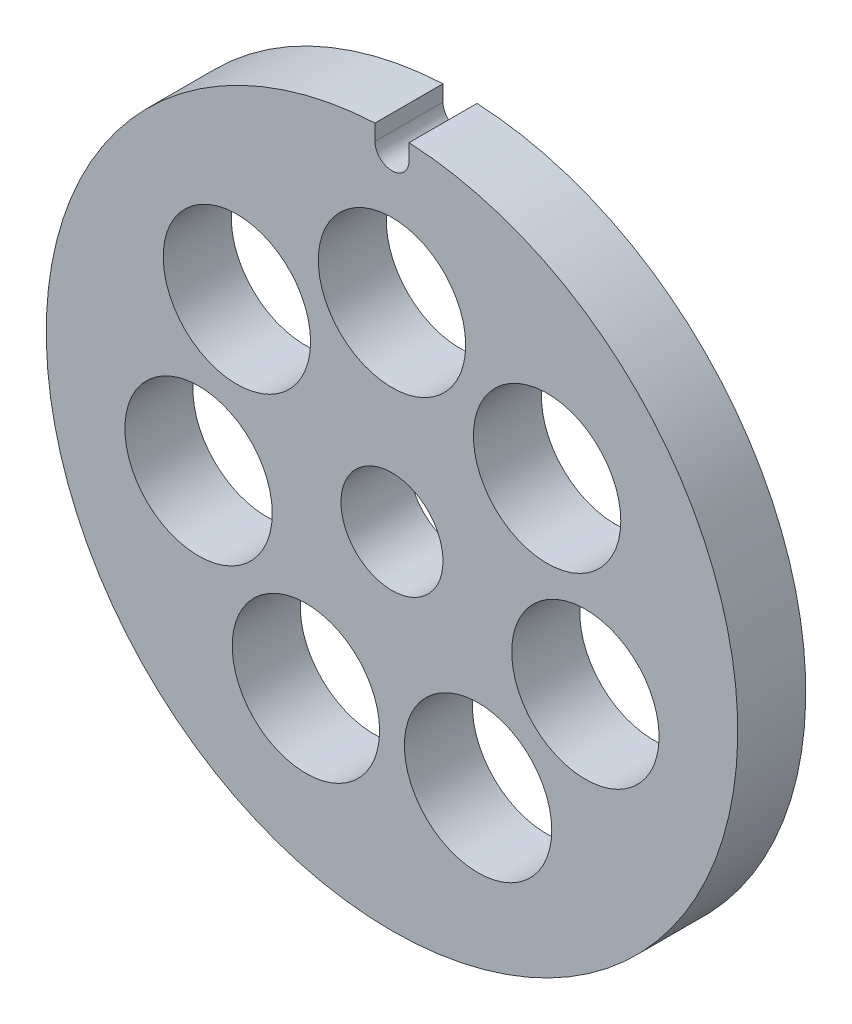
ISO-10303-21;
HEADER;
FILE_DESCRIPTION(('STEP AP214'),'2;1');
FILE_NAME('part.step','',(''),(''),'','','');
FILE_SCHEMA(('AUTOMOTIVE_DESIGN { 1 0 10303 214 1 1 1 1 }'));
ENDSEC;
DATA;
#1=APPLICATION_CONTEXT('core data for automotive mechanical design processes');
#2=APPLICATION_PROTOCOL_DEFINITION('international standard','automotive_design',2000,#1);
#3=PRODUCT_CONTEXT('',#1,'mechanical');
#4=PRODUCT('Part','Part','',(#3));
#5=PRODUCT_RELATED_PRODUCT_CATEGORY('part','',(#4));
#6=PRODUCT_DEFINITION_FORMATION('','',#4);
#7=PRODUCT_DEFINITION_CONTEXT('part definition',#1,'design');
#8=PRODUCT_DEFINITION('design','',#6,#7);
#9=PRODUCT_DEFINITION_SHAPE('','',#8);
#10=(LENGTH_UNIT() NAMED_UNIT(*) SI_UNIT(.MILLI.,.METRE.));
#11=(NAMED_UNIT(*) PLANE_ANGLE_UNIT() SI_UNIT($,.RADIAN.));
#12=(NAMED_UNIT(*) SI_UNIT($,.STERADIAN.) SOLID_ANGLE_UNIT());
#13=UNCERTAINTY_MEASURE_WITH_UNIT(LENGTH_MEASURE(1.E-05),#10,'distance_accuracy_value','');
#14=(GEOMETRIC_REPRESENTATION_CONTEXT(3) GLOBAL_UNCERTAINTY_ASSIGNED_CONTEXT((#13)) GLOBAL_UNIT_ASSIGNED_CONTEXT((#10,
#11,#12)) REPRESENTATION_CONTEXT('',''));
#15=CARTESIAN_POINT('',(0.,0.,0.));
#16=DIRECTION('',(0.,0.,1.));
#17=DIRECTION('',(1.,0.,0.));
#18=AXIS2_PLACEMENT_3D('',#15,#16,#17);
#19=CARTESIAN_POINT('',(0.,29.0630924234556,6.));
#20=DIRECTION('',(0.,0.,1.));
#21=DIRECTION('',(1.,0.,0.));
#22=AXIS2_PLACEMENT_3D('',#19,#20,#21);
#23=PLANE('',#22);
#24=CARTESIAN_POINT('',(-17.0612384631819,-3.8941163442355,6.));
#25=DIRECTION('',(0.,0.,1.));
#26=DIRECTION('',(1.,0.,0.));
#27=AXIS2_PLACEMENT_3D('',#24,#25,#26);
#28=CIRCLE('',#27,6.5);
#29=CARTESIAN_POINT('',(-10.5612384631819,-3.8941163442355,6.));
#30=VERTEX_POINT('',#29);
#31=EDGE_CURVE('E176',#30,#30,#28,.T.);
#32=ORIENTED_EDGE('',*,*,#31,.F.);
#33=EDGE_LOOP('',(#32));
#34=FACE_BOUND('',#33,.T.);
#35=CARTESIAN_POINT('',(7.59296543455727,-15.7669551882923,6.));
#36=DIRECTION('',(0.,0.,1.));
#37=DIRECTION('',(1.,0.,0.));
#38=AXIS2_PLACEMENT_3D('',#35,#36,#37);
#39=CIRCLE('',#38,6.5);
#40=CARTESIAN_POINT('',(14.0929654345573,-15.7669551882923,6.));
#41=VERTEX_POINT('',#40);
#42=EDGE_CURVE('E160',#41,#41,#39,.T.);
#43=ORIENTED_EDGE('',*,*,#42,.F.);
#44=EDGE_LOOP('',(#43));
#45=FACE_BOUND('',#44,.T.);
#46=CARTESIAN_POINT('',(13.6820509431905,10.9110715325278,6.));
#47=DIRECTION('',(0.,0.,1.));
#48=DIRECTION('',(1.,0.,0.));
#49=AXIS2_PLACEMENT_3D('',#46,#47,#48);
#50=CIRCLE('',#49,6.5);
#51=CARTESIAN_POINT('',(20.1820509431905,10.9110715325278,6.));
#52=VERTEX_POINT('',#51);
#53=EDGE_CURVE('E144',#52,#52,#50,.T.);
#54=ORIENTED_EDGE('',*,*,#53,.F.);
#55=EDGE_LOOP('',(#54));
#56=FACE_BOUND('',#55,.T.);
#57=CARTESIAN_POINT('',(0.,0.,6.));
#58=DIRECTION('',(0.,0.,1.));
#59=DIRECTION('',(1.,0.,0.));
#60=AXIS2_PLACEMENT_3D('',#57,#58,#59);
#61=CIRCLE('',#60,4.5);
#62=CARTESIAN_POINT('',(4.5,0.,6.));
#63=VERTEX_POINT('',#62);
#64=EDGE_CURVE('E114',#63,#63,#61,.T.);
#65=ORIENTED_EDGE('',*,*,#64,.F.);
#66=EDGE_LOOP('',(#65));
#67=FACE_BOUND('',#66,.T.);
#68=CARTESIAN_POINT('',(0.,29.0630924234556,6.));
#69=DIRECTION('',(0.,0.,-1.));
#70=DIRECTION('',(1.,0.,0.));
#71=AXIS2_PLACEMENT_3D('',#68,#69,#70);
#72=CIRCLE('',#71,1.5);
#73=CARTESIAN_POINT('',(1.5,29.0630924234556,6.));
#74=VERTEX_POINT('',#73);
#75=CARTESIAN_POINT('',(-1.5,29.0630924234556,6.));
#76=VERTEX_POINT('',#75);
#77=EDGE_CURVE('E94',#74,#76,#72,.T.);
#78=ORIENTED_EDGE('',*,*,#77,.T.);
#79=DIRECTION('',(0.,1.,0.));
#80=VECTOR('',#79,1.);
#81=CARTESIAN_POINT('',(-1.5,29.0630924234556,6.));
#82=LINE('',#81,#80);
#83=CARTESIAN_POINT('',(-1.5,30.4630924234556,6.));
#84=VERTEX_POINT('',#83);
#85=EDGE_CURVE('E89',#76,#84,#82,.T.);
#86=ORIENTED_EDGE('',*,*,#85,.T.);
#87=CARTESIAN_POINT('',(0.,0.,6.));
#88=DIRECTION('',(0.,0.,1.));
#89=DIRECTION('',(1.,0.,0.));
#90=AXIS2_PLACEMENT_3D('',#87,#88,#89);
#91=CIRCLE('',#90,30.5);
#92=CARTESIAN_POINT('',(1.5,30.4630924234556,6.));
#93=VERTEX_POINT('',#92);
#94=EDGE_CURVE('E92',#84,#93,#91,.T.);
#95=ORIENTED_EDGE('',*,*,#94,.T.);
#96=DIRECTION('',(0.,-1.,0.));
#97=VECTOR('',#96,1.);
#98=CARTESIAN_POINT('',(1.5,29.0630924234556,6.));
#99=LINE('',#98,#97);
#100=EDGE_CURVE('E59',#93,#74,#99,.T.);
#101=ORIENTED_EDGE('',*,*,#100,.T.);
#102=EDGE_LOOP('',(#78,#86,#95,#101));
#103=FACE_BOUND('',#102,.T.);
#104=CARTESIAN_POINT('',(0.,17.5,6.));
#105=DIRECTION('',(0.,0.,1.));
#106=DIRECTION('',(1.,0.,0.));
#107=AXIS2_PLACEMENT_3D('',#104,#105,#106);
#108=CIRCLE('',#107,6.5);
#109=CARTESIAN_POINT('',(6.5,17.5,6.));
#110=VERTEX_POINT('',#109);
#111=EDGE_CURVE('E136',#110,#110,#108,.T.);
#112=ORIENTED_EDGE('',*,*,#111,.F.);
#113=EDGE_LOOP('',(#112));
#114=FACE_BOUND('',#113,.T.);
#115=CARTESIAN_POINT('',(17.0612384631819,-3.8941163442355,6.));
#116=DIRECTION('',(0.,0.,1.));
#117=DIRECTION('',(1.,0.,0.));
#118=AXIS2_PLACEMENT_3D('',#115,#116,#117);
#119=CIRCLE('',#118,6.5);
#120=CARTESIAN_POINT('',(23.5612384631819,-3.8941163442355,6.));
#121=VERTEX_POINT('',#120);
#122=EDGE_CURVE('E152',#121,#121,#119,.T.);
#123=ORIENTED_EDGE('',*,*,#122,.F.);
#124=EDGE_LOOP('',(#123));
#125=FACE_BOUND('',#124,.T.);
#126=CARTESIAN_POINT('',(-7.59296543455726,-15.7669551882923,6.));
#127=DIRECTION('',(0.,0.,1.));
#128=DIRECTION('',(1.,0.,0.));
#129=AXIS2_PLACEMENT_3D('',#126,#127,#128);
#130=CIRCLE('',#129,6.5);
#131=CARTESIAN_POINT('',(-1.09296543455726,-15.7669551882923,6.));
#132=VERTEX_POINT('',#131);
#133=EDGE_CURVE('E168',#132,#132,#130,.T.);
#134=ORIENTED_EDGE('',*,*,#133,.F.);
#135=EDGE_LOOP('',(#134));
#136=FACE_BOUND('',#135,.T.);
#137=CARTESIAN_POINT('',(-13.6820509431905,10.9110715325278,6.));
#138=DIRECTION('',(0.,0.,1.));
#139=DIRECTION('',(1.,0.,0.));
#140=AXIS2_PLACEMENT_3D('',#137,#138,#139);
#141=CIRCLE('',#140,6.5);
#142=CARTESIAN_POINT('',(-7.18205094319052,10.9110715325278,6.));
#143=VERTEX_POINT('',#142);
#144=EDGE_CURVE('E184',#143,#143,#141,.T.);
#145=ORIENTED_EDGE('',*,*,#144,.F.);
#146=EDGE_LOOP('',(#145));
#147=FACE_BOUND('',#146,.T.);
#148=ADVANCED_FACE('F41',(#34,#45,#56,#67,#103,#114,#125,#136,#147),#23,.T.);
#149=CARTESIAN_POINT('',(0.,29.0630924234556,0.));
#150=DIRECTION('',(0.,0.,1.));
#151=DIRECTION('',(1.,0.,0.));
#152=AXIS2_PLACEMENT_3D('',#149,#150,#151);
#153=PLANE('',#152);
#154=CARTESIAN_POINT('',(0.,29.0630924234556,0.));
#155=DIRECTION('',(0.,0.,-1.));
#156=DIRECTION('',(1.,0.,0.));
#157=AXIS2_PLACEMENT_3D('',#154,#155,#156);
#158=CIRCLE('',#157,1.5);
#159=CARTESIAN_POINT('',(1.5,29.0630924234556,0.));
#160=VERTEX_POINT('',#159);
#161=CARTESIAN_POINT('',(-1.5,29.0630924234556,0.));
#162=VERTEX_POINT('',#161);
#163=EDGE_CURVE('E110',#160,#162,#158,.T.);
#164=ORIENTED_EDGE('',*,*,#163,.F.);
#165=DIRECTION('',(0.,-1.,0.));
#166=VECTOR('',#165,1.);
#167=CARTESIAN_POINT('',(1.5,29.0630924234556,0.));
#168=LINE('',#167,#166);
#169=CARTESIAN_POINT('',(1.5,30.4630924234556,0.));
#170=VERTEX_POINT('',#169);
#171=EDGE_CURVE('E82',#170,#160,#168,.T.);
#172=ORIENTED_EDGE('',*,*,#171,.F.);
#173=CARTESIAN_POINT('',(0.,0.,0.));
#174=DIRECTION('',(0.,0.,1.));
#175=DIRECTION('',(1.,0.,0.));
#176=AXIS2_PLACEMENT_3D('',#173,#174,#175);
#177=CIRCLE('',#176,30.5);
#178=CARTESIAN_POINT('',(-1.5,30.4630924234556,0.));
#179=VERTEX_POINT('',#178);
#180=EDGE_CURVE('E76',#179,#170,#177,.T.);
#181=ORIENTED_EDGE('',*,*,#180,.F.);
#182=DIRECTION('',(0.,1.,0.));
#183=VECTOR('',#182,1.);
#184=CARTESIAN_POINT('',(-1.5,29.0630924234556,0.));
#185=LINE('',#184,#183);
#186=EDGE_CURVE('E99',#162,#179,#185,.T.);
#187=ORIENTED_EDGE('',*,*,#186,.F.);
#188=EDGE_LOOP('',(#164,#172,#181,#187));
#189=FACE_BOUND('',#188,.T.);
#190=CARTESIAN_POINT('',(0.,0.,0.));
#191=DIRECTION('',(0.,0.,1.));
#192=DIRECTION('',(1.,0.,0.));
#193=AXIS2_PLACEMENT_3D('',#190,#191,#192);
#194=CIRCLE('',#193,4.5);
#195=CARTESIAN_POINT('',(4.5,0.,0.));
#196=VERTEX_POINT('',#195);
#197=EDGE_CURVE('E132',#196,#196,#194,.T.);
#198=ORIENTED_EDGE('',*,*,#197,.T.);
#199=EDGE_LOOP('',(#198));
#200=FACE_BOUND('',#199,.T.);
#201=CARTESIAN_POINT('',(0.,17.5,0.));
#202=DIRECTION('',(0.,0.,1.));
#203=DIRECTION('',(1.,0.,0.));
#204=AXIS2_PLACEMENT_3D('',#201,#202,#203);
#205=CIRCLE('',#204,6.5);
#206=CARTESIAN_POINT('',(6.5,17.5,0.));
#207=VERTEX_POINT('',#206);
#208=EDGE_CURVE('E140',#207,#207,#205,.T.);
#209=ORIENTED_EDGE('',*,*,#208,.T.);
#210=EDGE_LOOP('',(#209));
#211=FACE_BOUND('',#210,.T.);
#212=CARTESIAN_POINT('',(13.6820509431905,10.9110715325278,0.));
#213=DIRECTION('',(0.,0.,1.));
#214=DIRECTION('',(1.,0.,0.));
#215=AXIS2_PLACEMENT_3D('',#212,#213,#214);
#216=CIRCLE('',#215,6.5);
#217=CARTESIAN_POINT('',(20.1820509431905,10.9110715325278,0.));
#218=VERTEX_POINT('',#217);
#219=EDGE_CURVE('E148',#218,#218,#216,.T.);
#220=ORIENTED_EDGE('',*,*,#219,.T.);
#221=EDGE_LOOP('',(#220));
#222=FACE_BOUND('',#221,.T.);
#223=CARTESIAN_POINT('',(17.0612384631819,-3.8941163442355,0.));
#224=DIRECTION('',(0.,0.,1.));
#225=DIRECTION('',(1.,0.,0.));
#226=AXIS2_PLACEMENT_3D('',#223,#224,#225);
#227=CIRCLE('',#226,6.5);
#228=CARTESIAN_POINT('',(23.5612384631819,-3.8941163442355,0.));
#229=VERTEX_POINT('',#228);
#230=EDGE_CURVE('E156',#229,#229,#227,.T.);
#231=ORIENTED_EDGE('',*,*,#230,.T.);
#232=EDGE_LOOP('',(#231));
#233=FACE_BOUND('',#232,.T.);
#234=CARTESIAN_POINT('',(7.59296543455727,-15.7669551882923,0.));
#235=DIRECTION('',(0.,0.,1.));
#236=DIRECTION('',(1.,0.,0.));
#237=AXIS2_PLACEMENT_3D('',#234,#235,#236);
#238=CIRCLE('',#237,6.5);
#239=CARTESIAN_POINT('',(14.0929654345573,-15.7669551882923,0.));
#240=VERTEX_POINT('',#239);
#241=EDGE_CURVE('E164',#240,#240,#238,.T.);
#242=ORIENTED_EDGE('',*,*,#241,.T.);
#243=EDGE_LOOP('',(#242));
#244=FACE_BOUND('',#243,.T.);
#245=CARTESIAN_POINT('',(-7.59296543455726,-15.7669551882923,0.));
#246=DIRECTION('',(0.,0.,1.));
#247=DIRECTION('',(1.,0.,0.));
#248=AXIS2_PLACEMENT_3D('',#245,#246,#247);
#249=CIRCLE('',#248,6.5);
#250=CARTESIAN_POINT('',(-1.09296543455726,-15.7669551882923,0.));
#251=VERTEX_POINT('',#250);
#252=EDGE_CURVE('E172',#251,#251,#249,.T.);
#253=ORIENTED_EDGE('',*,*,#252,.T.);
#254=EDGE_LOOP('',(#253));
#255=FACE_BOUND('',#254,.T.);
#256=CARTESIAN_POINT('',(-17.0612384631819,-3.8941163442355,0.));
#257=DIRECTION('',(0.,0.,1.));
#258=DIRECTION('',(1.,0.,0.));
#259=AXIS2_PLACEMENT_3D('',#256,#257,#258);
#260=CIRCLE('',#259,6.5);
#261=CARTESIAN_POINT('',(-10.5612384631819,-3.8941163442355,0.));
#262=VERTEX_POINT('',#261);
#263=EDGE_CURVE('E180',#262,#262,#260,.T.);
#264=ORIENTED_EDGE('',*,*,#263,.T.);
#265=EDGE_LOOP('',(#264));
#266=FACE_BOUND('',#265,.T.);
#267=CARTESIAN_POINT('',(-13.6820509431905,10.9110715325278,0.));
#268=DIRECTION('',(0.,0.,1.));
#269=DIRECTION('',(1.,0.,0.));
#270=AXIS2_PLACEMENT_3D('',#267,#268,#269);
#271=CIRCLE('',#270,6.5);
#272=CARTESIAN_POINT('',(-7.18205094319052,10.9110715325278,0.));
#273=VERTEX_POINT('',#272);
#274=EDGE_CURVE('E188',#273,#273,#271,.T.);
#275=ORIENTED_EDGE('',*,*,#274,.T.);
#276=EDGE_LOOP('',(#275));
#277=FACE_BOUND('',#276,.T.);
#278=ADVANCED_FACE('F127',(#189,#200,#211,#222,#233,#244,#255,#266,#277),#153,.F.);
#279=CARTESIAN_POINT('',(0.,29.0630924234556,6.));
#280=DIRECTION('',(0.,0.,-1.));
#281=DIRECTION('',(-1.,0.,0.));
#282=AXIS2_PLACEMENT_3D('',#279,#280,#281);
#283=CYLINDRICAL_SURFACE('',#282,1.5);
#284=ORIENTED_EDGE('',*,*,#163,.T.);
#285=DIRECTION('',(0.,0.,-1.));
#286=VECTOR('',#285,1.);
#287=CARTESIAN_POINT('',(-1.5,29.0630924234556,6.));
#288=LINE('',#287,#286);
#289=EDGE_CURVE('E11',#76,#162,#288,.T.);
#290=ORIENTED_EDGE('',*,*,#289,.F.);
#291=ORIENTED_EDGE('',*,*,#77,.F.);
#292=DIRECTION('',(0.,0.,-1.));
#293=VECTOR('',#292,1.);
#294=CARTESIAN_POINT('',(1.5,29.0630924234556,6.));
#295=LINE('',#294,#293);
#296=EDGE_CURVE('E106',#74,#160,#295,.T.);
#297=ORIENTED_EDGE('',*,*,#296,.T.);
#298=EDGE_LOOP('',(#284,#290,#291,#297));
#299=FACE_BOUND('',#298,.T.);
#300=ADVANCED_FACE('F43',(#299),#283,.F.);
#301=CARTESIAN_POINT('',(-1.5,29.0630924234556,6.));
#302=DIRECTION('',(-1.,0.,0.));
#303=DIRECTION('',(0.,-1.,0.));
#304=AXIS2_PLACEMENT_3D('',#301,#302,#303);
#305=PLANE('',#304);
#306=ORIENTED_EDGE('',*,*,#186,.T.);
#307=DIRECTION('',(0.,0.,-1.));
#308=VECTOR('',#307,1.);
#309=CARTESIAN_POINT('',(-1.5,30.4630924234556,6.));
#310=LINE('',#309,#308);
#311=EDGE_CURVE('E51',#84,#179,#310,.T.);
#312=ORIENTED_EDGE('',*,*,#311,.F.);
#313=ORIENTED_EDGE('',*,*,#85,.F.);
#314=ORIENTED_EDGE('',*,*,#289,.T.);
#315=EDGE_LOOP('',(#306,#312,#313,#314));
#316=FACE_BOUND('',#315,.T.);
#317=ADVANCED_FACE('F98',(#316),#305,.F.);
#318=CARTESIAN_POINT('',(0.,0.,6.));
#319=DIRECTION('',(0.,0.,-1.));
#320=DIRECTION('',(-1.,0.,0.));
#321=AXIS2_PLACEMENT_3D('',#318,#319,#320);
#322=CYLINDRICAL_SURFACE('',#321,30.5);
#323=ORIENTED_EDGE('',*,*,#180,.T.);
#324=DIRECTION('',(0.,0.,-1.));
#325=VECTOR('',#324,1.);
#326=CARTESIAN_POINT('',(1.5,30.4630924234556,6.));
#327=LINE('',#326,#325);
#328=EDGE_CURVE('E101',#93,#170,#327,.T.);
#329=ORIENTED_EDGE('',*,*,#328,.F.);
#330=ORIENTED_EDGE('',*,*,#94,.F.);
#331=ORIENTED_EDGE('',*,*,#311,.T.);
#332=EDGE_LOOP('',(#323,#329,#330,#331));
#333=FACE_BOUND('',#332,.T.);
#334=ADVANCED_FACE('F102',(#333),#322,.T.);
#335=CARTESIAN_POINT('',(1.5,29.0630924234556,6.));
#336=DIRECTION('',(1.,0.,0.));
#337=DIRECTION('',(0.,1.,0.));
#338=AXIS2_PLACEMENT_3D('',#335,#336,#337);
#339=PLANE('',#338);
#340=ORIENTED_EDGE('',*,*,#171,.T.);
#341=ORIENTED_EDGE('',*,*,#296,.F.);
#342=ORIENTED_EDGE('',*,*,#100,.F.);
#343=ORIENTED_EDGE('',*,*,#328,.T.);
#344=EDGE_LOOP('',(#340,#341,#342,#343));
#345=FACE_BOUND('',#344,.T.);
#346=ADVANCED_FACE('F124',(#345),#339,.F.);
#347=CARTESIAN_POINT('',(0.,0.,6.));
#348=DIRECTION('',(0.,0.,-1.));
#349=DIRECTION('',(-1.,0.,0.));
#350=AXIS2_PLACEMENT_3D('',#347,#348,#349);
#351=CYLINDRICAL_SURFACE('',#350,4.5);
#352=ORIENTED_EDGE('',*,*,#64,.T.);
#353=EDGE_LOOP('',(#352));
#354=FACE_BOUND('',#353,.T.);
#355=ORIENTED_EDGE('',*,*,#197,.F.);
#356=EDGE_LOOP('',(#355));
#357=FACE_BOUND('',#356,.T.);
#358=ADVANCED_FACE('F209',(#354,#357),#351,.F.);
#359=CARTESIAN_POINT('',(0.,17.5,6.));
#360=DIRECTION('',(0.,0.,-1.));
#361=DIRECTION('',(-1.,0.,0.));
#362=AXIS2_PLACEMENT_3D('',#359,#360,#361);
#363=CYLINDRICAL_SURFACE('',#362,6.5);
#364=ORIENTED_EDGE('',*,*,#111,.T.);
#365=EDGE_LOOP('',(#364));
#366=FACE_BOUND('',#365,.T.);
#367=ORIENTED_EDGE('',*,*,#208,.F.);
#368=EDGE_LOOP('',(#367));
#369=FACE_BOUND('',#368,.T.);
#370=ADVANCED_FACE('F255',(#366,#369),#363,.F.);
#371=CARTESIAN_POINT('',(13.6820509431905,10.9110715325278,6.));
#372=DIRECTION('',(0.,0.,-1.));
#373=DIRECTION('',(-1.,0.,0.));
#374=AXIS2_PLACEMENT_3D('',#371,#372,#373);
#375=CYLINDRICAL_SURFACE('',#374,6.5);
#376=ORIENTED_EDGE('',*,*,#53,.T.);
#377=EDGE_LOOP('',(#376));
#378=FACE_BOUND('',#377,.T.);
#379=ORIENTED_EDGE('',*,*,#219,.F.);
#380=EDGE_LOOP('',(#379));
#381=FACE_BOUND('',#380,.T.);
#382=ADVANCED_FACE('F263',(#378,#381),#375,.F.);
#383=CARTESIAN_POINT('',(17.0612384631819,-3.8941163442355,6.));
#384=DIRECTION('',(0.,0.,-1.));
#385=DIRECTION('',(-1.,0.,0.));
#386=AXIS2_PLACEMENT_3D('',#383,#384,#385);
#387=CYLINDRICAL_SURFACE('',#386,6.5);
#388=ORIENTED_EDGE('',*,*,#122,.T.);
#389=EDGE_LOOP('',(#388));
#390=FACE_BOUND('',#389,.T.);
#391=ORIENTED_EDGE('',*,*,#230,.F.);
#392=EDGE_LOOP('',(#391));
#393=FACE_BOUND('',#392,.T.);
#394=ADVANCED_FACE('F271',(#390,#393),#387,.F.);
#395=CARTESIAN_POINT('',(7.59296543455727,-15.7669551882923,6.));
#396=DIRECTION('',(0.,0.,-1.));
#397=DIRECTION('',(-1.,0.,0.));
#398=AXIS2_PLACEMENT_3D('',#395,#396,#397);
#399=CYLINDRICAL_SURFACE('',#398,6.5);
#400=ORIENTED_EDGE('',*,*,#42,.T.);
#401=EDGE_LOOP('',(#400));
#402=FACE_BOUND('',#401,.T.);
#403=ORIENTED_EDGE('',*,*,#241,.F.);
#404=EDGE_LOOP('',(#403));
#405=FACE_BOUND('',#404,.T.);
#406=ADVANCED_FACE('F280',(#402,#405),#399,.F.);
#407=CARTESIAN_POINT('',(-7.59296543455726,-15.7669551882923,6.));
#408=DIRECTION('',(0.,0.,-1.));
#409=DIRECTION('',(-1.,0.,0.));
#410=AXIS2_PLACEMENT_3D('',#407,#408,#409);
#411=CYLINDRICAL_SURFACE('',#410,6.5);
#412=ORIENTED_EDGE('',*,*,#133,.T.);
#413=EDGE_LOOP('',(#412));
#414=FACE_BOUND('',#413,.T.);
#415=ORIENTED_EDGE('',*,*,#252,.F.);
#416=EDGE_LOOP('',(#415));
#417=FACE_BOUND('',#416,.T.);
#418=ADVANCED_FACE('F289',(#414,#417),#411,.F.);
#419=CARTESIAN_POINT('',(-17.0612384631819,-3.8941163442355,6.));
#420=DIRECTION('',(0.,0.,-1.));
#421=DIRECTION('',(-1.,0.,0.));
#422=AXIS2_PLACEMENT_3D('',#419,#420,#421);
#423=CYLINDRICAL_SURFACE('',#422,6.5);
#424=ORIENTED_EDGE('',*,*,#31,.T.);
#425=EDGE_LOOP('',(#424));
#426=FACE_BOUND('',#425,.T.);
#427=ORIENTED_EDGE('',*,*,#263,.F.);
#428=EDGE_LOOP('',(#427));
#429=FACE_BOUND('',#428,.T.);
#430=ADVANCED_FACE('F298',(#426,#429),#423,.F.);
#431=CARTESIAN_POINT('',(-13.6820509431905,10.9110715325278,6.));
#432=DIRECTION('',(0.,0.,-1.));
#433=DIRECTION('',(-1.,0.,0.));
#434=AXIS2_PLACEMENT_3D('',#431,#432,#433);
#435=CYLINDRICAL_SURFACE('',#434,6.5);
#436=ORIENTED_EDGE('',*,*,#144,.T.);
#437=EDGE_LOOP('',(#436));
#438=FACE_BOUND('',#437,.T.);
#439=ORIENTED_EDGE('',*,*,#274,.F.);
#440=EDGE_LOOP('',(#439));
#441=FACE_BOUND('',#440,.T.);
#442=ADVANCED_FACE('F196',(#438,#441),#435,.F.);
#443=CLOSED_SHELL('',(#148,#278,#300,#317,#334,#346,#358,#370,#382,#394,#406,#418,#430,#442));
#444=MANIFOLD_SOLID_BREP('B2',#443);
#445=ADVANCED_BREP_SHAPE_REPRESENTATION('',(#18,#444),#14);
#446=SHAPE_DEFINITION_REPRESENTATION(#9,#445);
ENDSEC;
END-ISO-10303-21;
